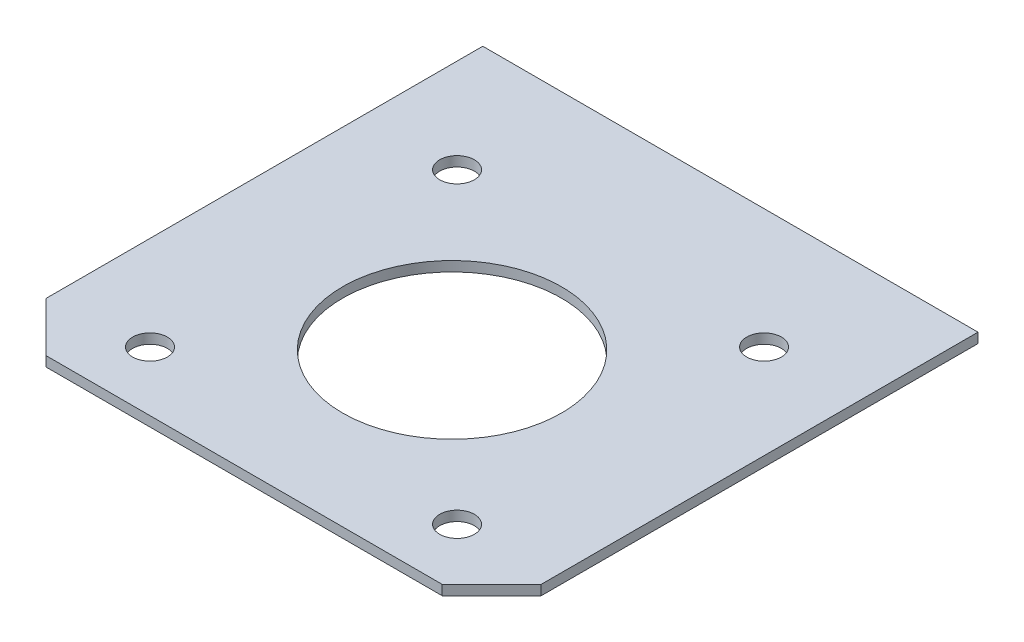
ISO-10303-21;
HEADER;
FILE_DESCRIPTION(('STEP AP214'),'2;1');
FILE_NAME('part.step','',(''),(''),'','','');
FILE_SCHEMA(('AUTOMOTIVE_DESIGN { 1 0 10303 214 1 1 1 1 }'));
ENDSEC;
DATA;
#1=APPLICATION_CONTEXT('core data for automotive mechanical design processes');
#2=APPLICATION_PROTOCOL_DEFINITION('international standard','automotive_design',2000,#1);
#3=PRODUCT_CONTEXT('',#1,'mechanical');
#4=PRODUCT('Part','Part','',(#3));
#5=PRODUCT_RELATED_PRODUCT_CATEGORY('part','',(#4));
#6=PRODUCT_DEFINITION_FORMATION('','',#4);
#7=PRODUCT_DEFINITION_CONTEXT('part definition',#1,'design');
#8=PRODUCT_DEFINITION('design','',#6,#7);
#9=PRODUCT_DEFINITION_SHAPE('','',#8);
#10=(LENGTH_UNIT() NAMED_UNIT(*) SI_UNIT(.MILLI.,.METRE.));
#11=(NAMED_UNIT(*) PLANE_ANGLE_UNIT() SI_UNIT($,.RADIAN.));
#12=(NAMED_UNIT(*) SI_UNIT($,.STERADIAN.) SOLID_ANGLE_UNIT());
#13=UNCERTAINTY_MEASURE_WITH_UNIT(LENGTH_MEASURE(1.E-05),#10,'distance_accuracy_value','');
#14=(GEOMETRIC_REPRESENTATION_CONTEXT(3) GLOBAL_UNCERTAINTY_ASSIGNED_CONTEXT((#13)) GLOBAL_UNIT_ASSIGNED_CONTEXT((#10,
#11,#12)) REPRESENTATION_CONTEXT('',''));
#15=CARTESIAN_POINT('',(0.,0.,0.));
#16=DIRECTION('',(0.,0.,1.));
#17=DIRECTION('',(1.,0.,0.));
#18=AXIS2_PLACEMENT_3D('',#15,#16,#17);
#19=CARTESIAN_POINT('',(0.,10.,0.));
#20=DIRECTION('',(0.,-1.,0.));
#21=DIRECTION('',(0.,0.,-1.));
#22=AXIS2_PLACEMENT_3D('',#19,#20,#21);
#23=PLANE('',#22);
#24=DIRECTION('',(1.,0.,0.));
#25=VECTOR('',#24,1.);
#26=CARTESIAN_POINT('',(-250.,10.,245.5));
#27=LINE('',#26,#25);
#28=CARTESIAN_POINT('',(-200.,10.,245.5));
#29=VERTEX_POINT('',#28);
#30=CARTESIAN_POINT('',(200.,10.,245.5));
#31=VERTEX_POINT('',#30);
#32=EDGE_CURVE('E130',#29,#31,#27,.T.);
#33=ORIENTED_EDGE('',*,*,#32,.T.);
#34=DIRECTION('',(-0.707106781186549,0.,0.707106781186546));
#35=VECTOR('',#34,1.);
#36=CARTESIAN_POINT('',(250.,10.,195.5));
#37=LINE('',#36,#35);
#38=CARTESIAN_POINT('',(250.,10.,195.5));
#39=VERTEX_POINT('',#38);
#40=EDGE_CURVE('E51',#31,#39,#37,.F.);
#41=ORIENTED_EDGE('',*,*,#40,.T.);
#42=DIRECTION('',(0.,0.,-1.));
#43=VECTOR('',#42,1.);
#44=CARTESIAN_POINT('',(250.,10.,245.5));
#45=LINE('',#44,#43);
#46=CARTESIAN_POINT('',(250.,10.,-245.5));
#47=VERTEX_POINT('',#46);
#48=EDGE_CURVE('E97',#39,#47,#45,.T.);
#49=ORIENTED_EDGE('',*,*,#48,.T.);
#50=DIRECTION('',(-1.,0.,0.));
#51=VECTOR('',#50,1.);
#52=CARTESIAN_POINT('',(-250.,10.,-245.5));
#53=LINE('',#52,#51);
#54=CARTESIAN_POINT('',(-250.,10.,-245.5));
#55=VERTEX_POINT('',#54);
#56=EDGE_CURVE('E100',#47,#55,#53,.T.);
#57=ORIENTED_EDGE('',*,*,#56,.T.);
#58=DIRECTION('',(0.,0.,1.));
#59=VECTOR('',#58,1.);
#60=CARTESIAN_POINT('',(-250.,10.,245.5));
#61=LINE('',#60,#59);
#62=CARTESIAN_POINT('',(-250.,10.,195.5));
#63=VERTEX_POINT('',#62);
#64=EDGE_CURVE('E117',#55,#63,#61,.T.);
#65=ORIENTED_EDGE('',*,*,#64,.T.);
#66=DIRECTION('',(-0.707106781186546,0.,-0.707106781186549));
#67=VECTOR('',#66,1.);
#68=CARTESIAN_POINT('',(-200.,10.,245.5));
#69=LINE('',#68,#67);
#70=EDGE_CURVE('E145',#63,#29,#69,.F.);
#71=ORIENTED_EDGE('',*,*,#70,.T.);
#72=EDGE_LOOP('',(#33,#41,#49,#57,#65,#71));
#73=FACE_BOUND('',#72,.T.);
#74=CARTESIAN_POINT('',(0.,10.,35.5));
#75=DIRECTION('',(0.,1.,0.));
#76=DIRECTION('',(0.,0.,1.));
#77=AXIS2_PLACEMENT_3D('',#74,#75,#76);
#78=CIRCLE('',#77,110.5);
#79=CARTESIAN_POINT('',(0.,10.,146.));
#80=VERTEX_POINT('',#79);
#81=EDGE_CURVE('E169',#80,#80,#78,.T.);
#82=ORIENTED_EDGE('',*,*,#81,.F.);
#83=EDGE_LOOP('',(#82));
#84=FACE_BOUND('',#83,.T.);
#85=CARTESIAN_POINT('',(-155.,10.,-124.5));
#86=DIRECTION('',(0.,1.,0.));
#87=DIRECTION('',(0.,0.,1.));
#88=AXIS2_PLACEMENT_3D('',#85,#86,#87);
#89=CIRCLE('',#88,17.5);
#90=CARTESIAN_POINT('',(-155.,10.,-107.));
#91=VERTEX_POINT('',#90);
#92=EDGE_CURVE('E177',#91,#91,#89,.T.);
#93=ORIENTED_EDGE('',*,*,#92,.F.);
#94=EDGE_LOOP('',(#93));
#95=FACE_BOUND('',#94,.T.);
#96=CARTESIAN_POINT('',(155.,10.,-124.5));
#97=DIRECTION('',(0.,1.,0.));
#98=DIRECTION('',(0.,0.,-1.));
#99=AXIS2_PLACEMENT_3D('',#96,#97,#98);
#100=CIRCLE('',#99,17.5);
#101=CARTESIAN_POINT('',(155.,10.,-142.));
#102=VERTEX_POINT('',#101);
#103=EDGE_CURVE('E185',#102,#102,#100,.T.);
#104=ORIENTED_EDGE('',*,*,#103,.F.);
#105=EDGE_LOOP('',(#104));
#106=FACE_BOUND('',#105,.T.);
#107=CARTESIAN_POINT('',(-155.000000000001,10.,185.5));
#108=DIRECTION('',(0.,1.,0.));
#109=DIRECTION('',(0.,0.,1.));
#110=AXIS2_PLACEMENT_3D('',#107,#108,#109);
#111=CIRCLE('',#110,17.5);
#112=CARTESIAN_POINT('',(-155.000000000001,10.,203.));
#113=VERTEX_POINT('',#112);
#114=EDGE_CURVE('E193',#113,#113,#111,.T.);
#115=ORIENTED_EDGE('',*,*,#114,.F.);
#116=EDGE_LOOP('',(#115));
#117=FACE_BOUND('',#116,.T.);
#118=CARTESIAN_POINT('',(155.000000000001,10.,185.5));
#119=DIRECTION('',(0.,1.,0.));
#120=DIRECTION('',(0.,0.,-1.));
#121=AXIS2_PLACEMENT_3D('',#118,#119,#120);
#122=CIRCLE('',#121,17.5);
#123=CARTESIAN_POINT('',(155.000000000001,10.,168.));
#124=VERTEX_POINT('',#123);
#125=EDGE_CURVE('E201',#124,#124,#122,.T.);
#126=ORIENTED_EDGE('',*,*,#125,.F.);
#127=EDGE_LOOP('',(#126));
#128=FACE_BOUND('',#127,.T.);
#129=ADVANCED_FACE('F41',(#73,#84,#95,#106,#117,#128),#23,.F.);
#130=CARTESIAN_POINT('',(0.,0.,0.));
#131=DIRECTION('',(0.,-1.,0.));
#132=DIRECTION('',(0.,0.,-1.));
#133=AXIS2_PLACEMENT_3D('',#130,#131,#132);
#134=PLANE('',#133);
#135=CARTESIAN_POINT('',(-155.000000000001,0.,185.5));
#136=DIRECTION('',(0.,1.,0.));
#137=DIRECTION('',(0.,0.,1.));
#138=AXIS2_PLACEMENT_3D('',#135,#136,#137);
#139=CIRCLE('',#138,17.5);
#140=CARTESIAN_POINT('',(-155.000000000001,0.,203.));
#141=VERTEX_POINT('',#140);
#142=EDGE_CURVE('E197',#141,#141,#139,.T.);
#143=ORIENTED_EDGE('',*,*,#142,.T.);
#144=EDGE_LOOP('',(#143));
#145=FACE_BOUND('',#144,.T.);
#146=CARTESIAN_POINT('',(-155.,0.,-124.5));
#147=DIRECTION('',(0.,1.,0.));
#148=DIRECTION('',(0.,0.,1.));
#149=AXIS2_PLACEMENT_3D('',#146,#147,#148);
#150=CIRCLE('',#149,17.5);
#151=CARTESIAN_POINT('',(-155.,0.,-107.));
#152=VERTEX_POINT('',#151);
#153=EDGE_CURVE('E181',#152,#152,#150,.T.);
#154=ORIENTED_EDGE('',*,*,#153,.T.);
#155=EDGE_LOOP('',(#154));
#156=FACE_BOUND('',#155,.T.);
#157=DIRECTION('',(0.,0.,-1.));
#158=VECTOR('',#157,1.);
#159=CARTESIAN_POINT('',(250.,0.,245.5));
#160=LINE('',#159,#158);
#161=CARTESIAN_POINT('',(250.,0.,195.5));
#162=VERTEX_POINT('',#161);
#163=CARTESIAN_POINT('',(250.,0.,-245.5));
#164=VERTEX_POINT('',#163);
#165=EDGE_CURVE('E121',#162,#164,#160,.T.);
#166=ORIENTED_EDGE('',*,*,#165,.F.);
#167=DIRECTION('',(0.707106781186549,0.,-0.707106781186546));
#168=VECTOR('',#167,1.);
#169=CARTESIAN_POINT('',(222.749999999999,0.,222.75));
#170=LINE('',#169,#168);
#171=CARTESIAN_POINT('',(200.,0.,245.5));
#172=VERTEX_POINT('',#171);
#173=EDGE_CURVE('E136',#162,#172,#170,.F.);
#174=ORIENTED_EDGE('',*,*,#173,.T.);
#175=DIRECTION('',(1.,0.,0.));
#176=VECTOR('',#175,1.);
#177=CARTESIAN_POINT('',(-250.,0.,245.5));
#178=LINE('',#177,#176);
#179=CARTESIAN_POINT('',(-200.,0.,245.5));
#180=VERTEX_POINT('',#179);
#181=EDGE_CURVE('E108',#180,#172,#178,.T.);
#182=ORIENTED_EDGE('',*,*,#181,.F.);
#183=DIRECTION('',(0.707106781186546,0.,0.707106781186549));
#184=VECTOR('',#183,1.);
#185=CARTESIAN_POINT('',(-222.750000000001,0.,222.75));
#186=LINE('',#185,#184);
#187=CARTESIAN_POINT('',(-250.,0.,195.5));
#188=VERTEX_POINT('',#187);
#189=EDGE_CURVE('E128',#180,#188,#186,.F.);
#190=ORIENTED_EDGE('',*,*,#189,.T.);
#191=DIRECTION('',(0.,0.,1.));
#192=VECTOR('',#191,1.);
#193=CARTESIAN_POINT('',(-250.,0.,245.5));
#194=LINE('',#193,#192);
#195=CARTESIAN_POINT('',(-250.,0.,-245.5));
#196=VERTEX_POINT('',#195);
#197=EDGE_CURVE('E159',#196,#188,#194,.T.);
#198=ORIENTED_EDGE('',*,*,#197,.F.);
#199=DIRECTION('',(-1.,0.,0.));
#200=VECTOR('',#199,1.);
#201=CARTESIAN_POINT('',(-250.,0.,-245.5));
#202=LINE('',#201,#200);
#203=EDGE_CURVE('E162',#164,#196,#202,.T.);
#204=ORIENTED_EDGE('',*,*,#203,.F.);
#205=EDGE_LOOP('',(#166,#174,#182,#190,#198,#204));
#206=FACE_BOUND('',#205,.T.);
#207=CARTESIAN_POINT('',(0.,0.,35.5));
#208=DIRECTION('',(0.,1.,0.));
#209=DIRECTION('',(0.,0.,1.));
#210=AXIS2_PLACEMENT_3D('',#207,#208,#209);
#211=CIRCLE('',#210,110.5);
#212=CARTESIAN_POINT('',(0.,0.,146.));
#213=VERTEX_POINT('',#212);
#214=EDGE_CURVE('E173',#213,#213,#211,.T.);
#215=ORIENTED_EDGE('',*,*,#214,.T.);
#216=EDGE_LOOP('',(#215));
#217=FACE_BOUND('',#216,.T.);
#218=CARTESIAN_POINT('',(155.,0.,-124.5));
#219=DIRECTION('',(0.,1.,0.));
#220=DIRECTION('',(0.,0.,-1.));
#221=AXIS2_PLACEMENT_3D('',#218,#219,#220);
#222=CIRCLE('',#221,17.5);
#223=CARTESIAN_POINT('',(155.,0.,-142.));
#224=VERTEX_POINT('',#223);
#225=EDGE_CURVE('E189',#224,#224,#222,.T.);
#226=ORIENTED_EDGE('',*,*,#225,.T.);
#227=EDGE_LOOP('',(#226));
#228=FACE_BOUND('',#227,.T.);
#229=CARTESIAN_POINT('',(155.000000000001,0.,185.5));
#230=DIRECTION('',(0.,1.,0.));
#231=DIRECTION('',(0.,0.,-1.));
#232=AXIS2_PLACEMENT_3D('',#229,#230,#231);
#233=CIRCLE('',#232,17.5);
#234=CARTESIAN_POINT('',(155.000000000001,0.,168.));
#235=VERTEX_POINT('',#234);
#236=EDGE_CURVE('E205',#235,#235,#233,.T.);
#237=ORIENTED_EDGE('',*,*,#236,.T.);
#238=EDGE_LOOP('',(#237));
#239=FACE_BOUND('',#238,.T.);
#240=ADVANCED_FACE('F157',(#145,#156,#206,#217,#228,#239),#134,.T.);
#241=CARTESIAN_POINT('',(250.,10.,245.5));
#242=DIRECTION('',(-1.,0.,0.));
#243=DIRECTION('',(0.,0.,1.));
#244=AXIS2_PLACEMENT_3D('',#241,#242,#243);
#245=PLANE('',#244);
#246=ORIENTED_EDGE('',*,*,#48,.F.);
#247=DIRECTION('',(0.,-1.,0.));
#248=VECTOR('',#247,1.);
#249=CARTESIAN_POINT('',(250.,10.,195.5));
#250=LINE('',#249,#248);
#251=EDGE_CURVE('E124',#39,#162,#250,.T.);
#252=ORIENTED_EDGE('',*,*,#251,.T.);
#253=ORIENTED_EDGE('',*,*,#165,.T.);
#254=DIRECTION('',(0.,-1.,0.));
#255=VECTOR('',#254,1.);
#256=CARTESIAN_POINT('',(250.,10.,-245.5));
#257=LINE('',#256,#255);
#258=EDGE_CURVE('E113',#47,#164,#257,.T.);
#259=ORIENTED_EDGE('',*,*,#258,.F.);
#260=EDGE_LOOP('',(#246,#252,#253,#259));
#261=FACE_BOUND('',#260,.T.);
#262=ADVANCED_FACE('F119',(#261),#245,.F.);
#263=CARTESIAN_POINT('',(-250.,10.,-245.5));
#264=DIRECTION('',(0.,0.,1.));
#265=DIRECTION('',(1.,0.,0.));
#266=AXIS2_PLACEMENT_3D('',#263,#264,#265);
#267=PLANE('',#266);
#268=ORIENTED_EDGE('',*,*,#203,.T.);
#269=DIRECTION('',(0.,-1.,0.));
#270=VECTOR('',#269,1.);
#271=CARTESIAN_POINT('',(-250.,10.,-245.5));
#272=LINE('',#271,#270);
#273=EDGE_CURVE('E115',#55,#196,#272,.T.);
#274=ORIENTED_EDGE('',*,*,#273,.F.);
#275=ORIENTED_EDGE('',*,*,#56,.F.);
#276=ORIENTED_EDGE('',*,*,#258,.T.);
#277=EDGE_LOOP('',(#268,#274,#275,#276));
#278=FACE_BOUND('',#277,.T.);
#279=ADVANCED_FACE('F112',(#278),#267,.F.);
#280=CARTESIAN_POINT('',(-250.,10.,245.5));
#281=DIRECTION('',(1.,0.,0.));
#282=DIRECTION('',(0.,0.,-1.));
#283=AXIS2_PLACEMENT_3D('',#280,#281,#282);
#284=PLANE('',#283);
#285=ORIENTED_EDGE('',*,*,#197,.T.);
#286=DIRECTION('',(0.,1.,0.));
#287=VECTOR('',#286,1.);
#288=CARTESIAN_POINT('',(-250.,10.,195.5));
#289=LINE('',#288,#287);
#290=EDGE_CURVE('E11',#188,#63,#289,.T.);
#291=ORIENTED_EDGE('',*,*,#290,.T.);
#292=ORIENTED_EDGE('',*,*,#64,.F.);
#293=ORIENTED_EDGE('',*,*,#273,.T.);
#294=EDGE_LOOP('',(#285,#291,#292,#293));
#295=FACE_BOUND('',#294,.T.);
#296=ADVANCED_FACE('F160',(#295),#284,.F.);
#297=CARTESIAN_POINT('',(-250.,10.,245.5));
#298=DIRECTION('',(0.,0.,-1.));
#299=DIRECTION('',(-1.,0.,0.));
#300=AXIS2_PLACEMENT_3D('',#297,#298,#299);
#301=PLANE('',#300);
#302=ORIENTED_EDGE('',*,*,#181,.T.);
#303=DIRECTION('',(0.,1.,0.));
#304=VECTOR('',#303,1.);
#305=CARTESIAN_POINT('',(200.,10.,245.5));
#306=LINE('',#305,#304);
#307=EDGE_CURVE('E64',#172,#31,#306,.T.);
#308=ORIENTED_EDGE('',*,*,#307,.T.);
#309=ORIENTED_EDGE('',*,*,#32,.F.);
#310=DIRECTION('',(0.,-1.,0.));
#311=VECTOR('',#310,1.);
#312=CARTESIAN_POINT('',(-200.,10.,245.5));
#313=LINE('',#312,#311);
#314=EDGE_CURVE('E139',#29,#180,#313,.T.);
#315=ORIENTED_EDGE('',*,*,#314,.T.);
#316=EDGE_LOOP('',(#302,#308,#309,#315));
#317=FACE_BOUND('',#316,.T.);
#318=ADVANCED_FACE('F151',(#317),#301,.F.);
#319=CARTESIAN_POINT('',(0.,10.,35.5));
#320=DIRECTION('',(0.,-1.,0.));
#321=DIRECTION('',(0.,0.,-1.));
#322=AXIS2_PLACEMENT_3D('',#319,#320,#321);
#323=CYLINDRICAL_SURFACE('',#322,110.5);
#324=ORIENTED_EDGE('',*,*,#81,.T.);
#325=EDGE_LOOP('',(#324));
#326=FACE_BOUND('',#325,.T.);
#327=ORIENTED_EDGE('',*,*,#214,.F.);
#328=EDGE_LOOP('',(#327));
#329=FACE_BOUND('',#328,.T.);
#330=ADVANCED_FACE('F224',(#326,#329),#323,.F.);
#331=CARTESIAN_POINT('',(-155.,10.,-124.5));
#332=DIRECTION('',(0.,-1.,0.));
#333=DIRECTION('',(0.,0.,-1.));
#334=AXIS2_PLACEMENT_3D('',#331,#332,#333);
#335=CYLINDRICAL_SURFACE('',#334,17.5);
#336=ORIENTED_EDGE('',*,*,#92,.T.);
#337=EDGE_LOOP('',(#336));
#338=FACE_BOUND('',#337,.T.);
#339=ORIENTED_EDGE('',*,*,#153,.F.);
#340=EDGE_LOOP('',(#339));
#341=FACE_BOUND('',#340,.T.);
#342=ADVANCED_FACE('F254',(#338,#341),#335,.F.);
#343=CARTESIAN_POINT('',(155.,10.,-124.5));
#344=DIRECTION('',(0.,-1.,0.));
#345=DIRECTION('',(0.,0.,-1.));
#346=AXIS2_PLACEMENT_3D('',#343,#344,#345);
#347=CYLINDRICAL_SURFACE('',#346,17.5);
#348=ORIENTED_EDGE('',*,*,#103,.T.);
#349=EDGE_LOOP('',(#348));
#350=FACE_BOUND('',#349,.T.);
#351=ORIENTED_EDGE('',*,*,#225,.F.);
#352=EDGE_LOOP('',(#351));
#353=FACE_BOUND('',#352,.T.);
#354=ADVANCED_FACE('F249',(#350,#353),#347,.F.);
#355=CARTESIAN_POINT('',(-155.000000000001,10.,185.5));
#356=DIRECTION('',(0.,-1.,0.));
#357=DIRECTION('',(0.,0.,-1.));
#358=AXIS2_PLACEMENT_3D('',#355,#356,#357);
#359=CYLINDRICAL_SURFACE('',#358,17.5);
#360=ORIENTED_EDGE('',*,*,#114,.T.);
#361=EDGE_LOOP('',(#360));
#362=FACE_BOUND('',#361,.T.);
#363=ORIENTED_EDGE('',*,*,#142,.F.);
#364=EDGE_LOOP('',(#363));
#365=FACE_BOUND('',#364,.T.);
#366=ADVANCED_FACE('F244',(#362,#365),#359,.F.);
#367=CARTESIAN_POINT('',(155.000000000001,10.,185.5));
#368=DIRECTION('',(0.,-1.,0.));
#369=DIRECTION('',(0.,0.,-1.));
#370=AXIS2_PLACEMENT_3D('',#367,#368,#369);
#371=CYLINDRICAL_SURFACE('',#370,17.5);
#372=ORIENTED_EDGE('',*,*,#125,.T.);
#373=EDGE_LOOP('',(#372));
#374=FACE_BOUND('',#373,.T.);
#375=ORIENTED_EDGE('',*,*,#236,.F.);
#376=EDGE_LOOP('',(#375));
#377=FACE_BOUND('',#376,.T.);
#378=ADVANCED_FACE('F213',(#374,#377),#371,.F.);
#379=CARTESIAN_POINT('',(250.,10.,195.5));
#380=DIRECTION('',(-0.707106781186546,0.,-0.707106781186549));
#381=DIRECTION('',(0.,-1.,0.));
#382=AXIS2_PLACEMENT_3D('',#379,#380,#381);
#383=PLANE('',#382);
#384=ORIENTED_EDGE('',*,*,#40,.F.);
#385=ORIENTED_EDGE('',*,*,#307,.F.);
#386=ORIENTED_EDGE('',*,*,#173,.F.);
#387=ORIENTED_EDGE('',*,*,#251,.F.);
#388=EDGE_LOOP('',(#384,#385,#386,#387));
#389=FACE_BOUND('',#388,.T.);
#390=ADVANCED_FACE('F235',(#389),#383,.F.);
#391=CARTESIAN_POINT('',(-200.,10.,245.5));
#392=DIRECTION('',(0.707106781186549,0.,-0.707106781186546));
#393=DIRECTION('',(0.,-1.,0.));
#394=AXIS2_PLACEMENT_3D('',#391,#392,#393);
#395=PLANE('',#394);
#396=ORIENTED_EDGE('',*,*,#70,.F.);
#397=ORIENTED_EDGE('',*,*,#290,.F.);
#398=ORIENTED_EDGE('',*,*,#189,.F.);
#399=ORIENTED_EDGE('',*,*,#314,.F.);
#400=EDGE_LOOP('',(#396,#397,#398,#399));
#401=FACE_BOUND('',#400,.T.);
#402=ADVANCED_FACE('F44',(#401),#395,.F.);
#403=CLOSED_SHELL('',(#129,#240,#262,#279,#296,#318,#330,#342,#354,#366,#378,#390,#402));
#404=MANIFOLD_SOLID_BREP('B2',#403);
#405=ADVANCED_BREP_SHAPE_REPRESENTATION('',(#18,#404),#14);
#406=SHAPE_DEFINITION_REPRESENTATION(#9,#405);
ENDSEC;
END-ISO-10303-21;
